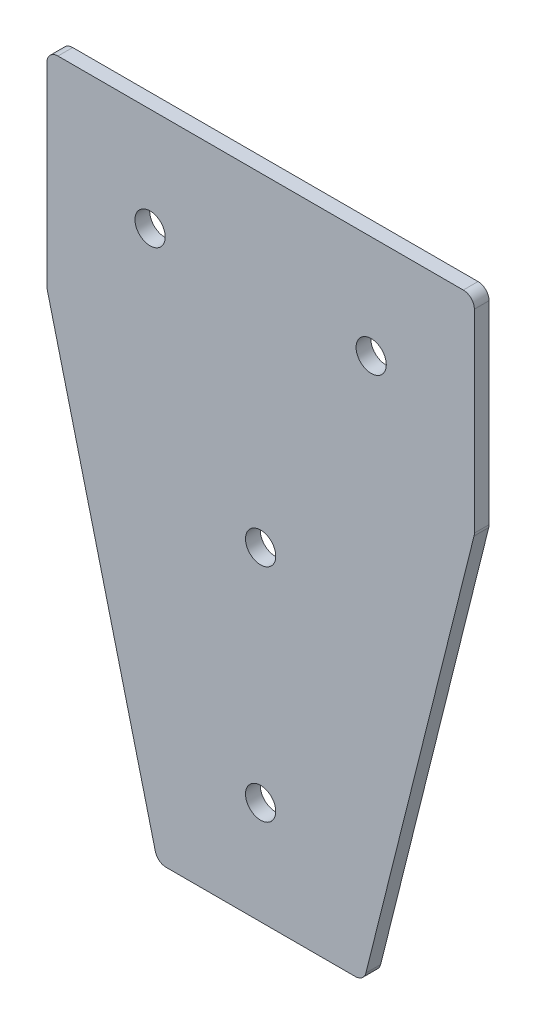
ISO-10303-21;
HEADER;
FILE_DESCRIPTION(('STEP AP214'),'2;1');
FILE_NAME('part.step','',(''),(''),'','','');
FILE_SCHEMA(('AUTOMOTIVE_DESIGN { 1 0 10303 214 1 1 1 1 }'));
ENDSEC;
DATA;
#1=APPLICATION_CONTEXT('core data for automotive mechanical design processes');
#2=APPLICATION_PROTOCOL_DEFINITION('international standard','automotive_design',2000,#1);
#3=PRODUCT_CONTEXT('',#1,'mechanical');
#4=PRODUCT('Part','Part','',(#3));
#5=PRODUCT_RELATED_PRODUCT_CATEGORY('part','',(#4));
#6=PRODUCT_DEFINITION_FORMATION('','',#4);
#7=PRODUCT_DEFINITION_CONTEXT('part definition',#1,'design');
#8=PRODUCT_DEFINITION('design','',#6,#7);
#9=PRODUCT_DEFINITION_SHAPE('','',#8);
#10=(LENGTH_UNIT() NAMED_UNIT(*) SI_UNIT(.MILLI.,.METRE.));
#11=(NAMED_UNIT(*) PLANE_ANGLE_UNIT() SI_UNIT($,.RADIAN.));
#12=(NAMED_UNIT(*) SI_UNIT($,.STERADIAN.) SOLID_ANGLE_UNIT());
#13=UNCERTAINTY_MEASURE_WITH_UNIT(LENGTH_MEASURE(1.E-05),#10,'distance_accuracy_value','');
#14=(GEOMETRIC_REPRESENTATION_CONTEXT(3) GLOBAL_UNCERTAINTY_ASSIGNED_CONTEXT((#13)) GLOBAL_UNIT_ASSIGNED_CONTEXT((#10,
#11,#12)) REPRESENTATION_CONTEXT('',''));
#15=CARTESIAN_POINT('',(0.,0.,0.));
#16=DIRECTION('',(0.,0.,1.));
#17=DIRECTION('',(1.,0.,0.));
#18=AXIS2_PLACEMENT_3D('',#15,#16,#17);
#19=CARTESIAN_POINT('',(0.,0.,4.));
#20=DIRECTION('',(0.,0.,1.));
#21=DIRECTION('',(1.,0.,0.));
#22=AXIS2_PLACEMENT_3D('',#19,#20,#21);
#23=PLANE('',#22);
#24=CARTESIAN_POINT('',(30.0000000000006,-120.000000000001,4.));
#25=DIRECTION('',(0.,0.,1.));
#26=DIRECTION('',(1.,0.,0.));
#27=AXIS2_PLACEMENT_3D('',#24,#25,#26);
#28=CIRCLE('',#27,4.09999999999998);
#29=CARTESIAN_POINT('',(34.1000000000006,-120.000000000001,4.));
#30=VERTEX_POINT('',#29);
#31=EDGE_CURVE('E214',#30,#30,#28,.T.);
#32=ORIENTED_EDGE('',*,*,#31,.F.);
#33=EDGE_LOOP('',(#32));
#34=FACE_BOUND('',#33,.T.);
#35=CARTESIAN_POINT('',(0.,0.,4.));
#36=DIRECTION('',(0.,0.,1.));
#37=DIRECTION('',(1.,0.,0.));
#38=AXIS2_PLACEMENT_3D('',#35,#36,#37);
#39=CIRCLE('',#38,4.1);
#40=CARTESIAN_POINT('',(4.1,0.,4.));
#41=VERTEX_POINT('',#40);
#42=EDGE_CURVE('E204',#41,#41,#39,.T.);
#43=ORIENTED_EDGE('',*,*,#42,.F.);
#44=EDGE_LOOP('',(#43));
#45=FACE_BOUND('',#44,.T.);
#46=DIRECTION('',(0.242535625036333,0.970142500145332,0.));
#47=VECTOR('',#46,1.);
#48=CARTESIAN_POINT('',(88.,-28.,4.));
#49=LINE('',#48,#47);
#50=CARTESIAN_POINT('',(58.5680982812228,-145.727606875109,4.));
#51=VERTEX_POINT('',#50);
#52=CARTESIAN_POINT('',(87.910427500436,-28.3582899982562,4.));
#53=VERTEX_POINT('',#52);
#54=EDGE_CURVE('E236',#51,#53,#49,.T.);
#55=ORIENTED_EDGE('',*,*,#54,.T.);
#56=CARTESIAN_POINT('',(85.,-27.6306831231472,4.));
#57=DIRECTION('',(0.,0.,1.));
#58=DIRECTION('',(1.,0.,0.));
#59=AXIS2_PLACEMENT_3D('',#56,#57,#58);
#60=CIRCLE('',#59,3.);
#61=CARTESIAN_POINT('',(88.,-27.6306831231472,4.));
#62=VERTEX_POINT('',#61);
#63=EDGE_CURVE('E163',#53,#62,#60,.T.);
#64=ORIENTED_EDGE('',*,*,#63,.T.);
#65=DIRECTION('',(0.,1.,0.));
#66=VECTOR('',#65,1.);
#67=CARTESIAN_POINT('',(88.,28.,4.));
#68=LINE('',#67,#66);
#69=CARTESIAN_POINT('',(88.,25.,4.));
#70=VERTEX_POINT('',#69);
#71=EDGE_CURVE('E124',#62,#70,#68,.T.);
#72=ORIENTED_EDGE('',*,*,#71,.T.);
#73=CARTESIAN_POINT('',(85.,25.,4.));
#74=DIRECTION('',(0.,0.,1.));
#75=DIRECTION('',(1.,0.,0.));
#76=AXIS2_PLACEMENT_3D('',#73,#74,#75);
#77=CIRCLE('',#76,3.);
#78=CARTESIAN_POINT('',(85.,28.,4.));
#79=VERTEX_POINT('',#78);
#80=EDGE_CURVE('E36',#70,#79,#77,.T.);
#81=ORIENTED_EDGE('',*,*,#80,.T.);
#82=DIRECTION('',(-1.,0.,0.));
#83=VECTOR('',#82,1.);
#84=CARTESIAN_POINT('',(-28.,28.,4.));
#85=LINE('',#84,#83);
#86=CARTESIAN_POINT('',(-25.,28.,4.));
#87=VERTEX_POINT('',#86);
#88=EDGE_CURVE('E141',#79,#87,#85,.T.);
#89=ORIENTED_EDGE('',*,*,#88,.T.);
#90=CARTESIAN_POINT('',(-25.,25.,4.));
#91=DIRECTION('',(0.,0.,1.));
#92=DIRECTION('',(1.,0.,0.));
#93=AXIS2_PLACEMENT_3D('',#90,#91,#92);
#94=CIRCLE('',#93,3.);
#95=CARTESIAN_POINT('',(-28.,25.,4.));
#96=VERTEX_POINT('',#95);
#97=EDGE_CURVE('E155',#87,#96,#94,.T.);
#98=ORIENTED_EDGE('',*,*,#97,.T.);
#99=DIRECTION('',(0.,-1.,0.));
#100=VECTOR('',#99,1.);
#101=CARTESIAN_POINT('',(-28.,28.,4.));
#102=LINE('',#101,#100);
#103=CARTESIAN_POINT('',(-28.,-27.630683123147,4.));
#104=VERTEX_POINT('',#103);
#105=EDGE_CURVE('E134',#96,#104,#102,.T.);
#106=ORIENTED_EDGE('',*,*,#105,.T.);
#107=CARTESIAN_POINT('',(-25.,-27.630683123147,4.));
#108=DIRECTION('',(0.,0.,1.));
#109=DIRECTION('',(1.,0.,0.));
#110=AXIS2_PLACEMENT_3D('',#107,#108,#109);
#111=CIRCLE('',#110,3.);
#112=CARTESIAN_POINT('',(-27.910427500436,-28.358289998256,4.));
#113=VERTEX_POINT('',#112);
#114=EDGE_CURVE('E157',#104,#113,#111,.T.);
#115=ORIENTED_EDGE('',*,*,#114,.T.);
#116=DIRECTION('',(0.242535625036333,-0.970142500145332,0.));
#117=VECTOR('',#116,1.);
#118=CARTESIAN_POINT('',(-28.,-28.,4.));
#119=LINE('',#118,#117);
#120=CARTESIAN_POINT('',(1.43190171877727,-145.727606875109,4.));
#121=VERTEX_POINT('',#120);
#122=EDGE_CURVE('E231',#113,#121,#119,.T.);
#123=ORIENTED_EDGE('',*,*,#122,.T.);
#124=CARTESIAN_POINT('',(4.34232921921326,-145.,4.));
#125=DIRECTION('',(0.,0.,1.));
#126=DIRECTION('',(1.,0.,0.));
#127=AXIS2_PLACEMENT_3D('',#124,#125,#126);
#128=CIRCLE('',#127,3.);
#129=CARTESIAN_POINT('',(4.34232921921326,-148.,4.));
#130=VERTEX_POINT('',#129);
#131=EDGE_CURVE('E159',#121,#130,#128,.T.);
#132=ORIENTED_EDGE('',*,*,#131,.T.);
#133=DIRECTION('',(1.,0.,0.));
#134=VECTOR('',#133,1.);
#135=CARTESIAN_POINT('',(2.00000000000002,-148.,4.));
#136=LINE('',#135,#134);
#137=CARTESIAN_POINT('',(55.6576707807868,-148.,4.));
#138=VERTEX_POINT('',#137);
#139=EDGE_CURVE('E195',#130,#138,#136,.T.);
#140=ORIENTED_EDGE('',*,*,#139,.T.);
#141=CARTESIAN_POINT('',(55.6576707807868,-145.,4.));
#142=DIRECTION('',(0.,0.,1.));
#143=DIRECTION('',(1.,0.,0.));
#144=AXIS2_PLACEMENT_3D('',#141,#142,#143);
#145=CIRCLE('',#144,3.);
#146=EDGE_CURVE('E161',#138,#51,#145,.T.);
#147=ORIENTED_EDGE('',*,*,#146,.T.);
#148=EDGE_LOOP('',(#55,#64,#72,#81,#89,#98,#106,#115,#123,#132,#140,#147));
#149=FACE_BOUND('',#148,.T.);
#150=CARTESIAN_POINT('',(60.,0.,4.));
#151=DIRECTION('',(0.,0.,1.));
#152=DIRECTION('',(1.,0.,0.));
#153=AXIS2_PLACEMENT_3D('',#150,#151,#152);
#154=CIRCLE('',#153,4.09999999999999);
#155=CARTESIAN_POINT('',(64.1,0.,4.));
#156=VERTEX_POINT('',#155);
#157=EDGE_CURVE('E209',#156,#156,#154,.T.);
#158=ORIENTED_EDGE('',*,*,#157,.F.);
#159=EDGE_LOOP('',(#158));
#160=FACE_BOUND('',#159,.T.);
#161=CARTESIAN_POINT('',(30.,-60.,4.));
#162=DIRECTION('',(0.,0.,1.));
#163=DIRECTION('',(1.,0.,0.));
#164=AXIS2_PLACEMENT_3D('',#161,#162,#163);
#165=CIRCLE('',#164,4.1);
#166=CARTESIAN_POINT('',(34.1,-60.,4.));
#167=VERTEX_POINT('',#166);
#168=EDGE_CURVE('E220',#167,#167,#165,.T.);
#169=ORIENTED_EDGE('',*,*,#168,.F.);
#170=EDGE_LOOP('',(#169));
#171=FACE_BOUND('',#170,.T.);
#172=ADVANCED_FACE('F16',(#34,#45,#149,#160,#171),#23,.T.);
#173=CARTESIAN_POINT('',(0.,0.,0.));
#174=DIRECTION('',(0.,0.,1.));
#175=DIRECTION('',(1.,0.,0.));
#176=AXIS2_PLACEMENT_3D('',#173,#174,#175);
#177=PLANE('',#176);
#178=DIRECTION('',(0.,1.,0.));
#179=VECTOR('',#178,1.);
#180=CARTESIAN_POINT('',(88.,28.,0.));
#181=LINE('',#180,#179);
#182=CARTESIAN_POINT('',(88.,-27.6306831231472,0.));
#183=VERTEX_POINT('',#182);
#184=CARTESIAN_POINT('',(88.,25.,0.));
#185=VERTEX_POINT('',#184);
#186=EDGE_CURVE('E122',#183,#185,#181,.T.);
#187=ORIENTED_EDGE('',*,*,#186,.F.);
#188=CARTESIAN_POINT('',(85.,-27.6306831231472,0.));
#189=DIRECTION('',(0.,0.,1.));
#190=DIRECTION('',(1.,0.,0.));
#191=AXIS2_PLACEMENT_3D('',#188,#189,#190);
#192=CIRCLE('',#191,3.);
#193=CARTESIAN_POINT('',(87.910427500436,-28.3582899982562,0.));
#194=VERTEX_POINT('',#193);
#195=EDGE_CURVE('E105',#183,#194,#192,.F.);
#196=ORIENTED_EDGE('',*,*,#195,.T.);
#197=DIRECTION('',(-0.242535625036333,-0.970142500145332,0.));
#198=VECTOR('',#197,1.);
#199=CARTESIAN_POINT('',(88.,-28.,0.));
#200=LINE('',#199,#198);
#201=CARTESIAN_POINT('',(58.5680982812228,-145.727606875109,0.));
#202=VERTEX_POINT('',#201);
#203=EDGE_CURVE('E234',#194,#202,#200,.T.);
#204=ORIENTED_EDGE('',*,*,#203,.T.);
#205=CARTESIAN_POINT('',(55.6576707807868,-145.,0.));
#206=DIRECTION('',(0.,0.,1.));
#207=DIRECTION('',(1.,0.,0.));
#208=AXIS2_PLACEMENT_3D('',#205,#206,#207);
#209=CIRCLE('',#208,3.);
#210=CARTESIAN_POINT('',(55.6576707807868,-148.,0.));
#211=VERTEX_POINT('',#210);
#212=EDGE_CURVE('E116',#202,#211,#209,.F.);
#213=ORIENTED_EDGE('',*,*,#212,.T.);
#214=DIRECTION('',(1.,0.,0.));
#215=VECTOR('',#214,1.);
#216=CARTESIAN_POINT('',(2.00000000000002,-148.,0.));
#217=LINE('',#216,#215);
#218=CARTESIAN_POINT('',(4.34232921921326,-148.,0.));
#219=VERTEX_POINT('',#218);
#220=EDGE_CURVE('E132',#219,#211,#217,.T.);
#221=ORIENTED_EDGE('',*,*,#220,.F.);
#222=CARTESIAN_POINT('',(4.34232921921326,-145.,0.));
#223=DIRECTION('',(0.,0.,1.));
#224=DIRECTION('',(1.,0.,0.));
#225=AXIS2_PLACEMENT_3D('',#222,#223,#224);
#226=CIRCLE('',#225,3.);
#227=CARTESIAN_POINT('',(1.43190171877727,-145.727606875109,0.));
#228=VERTEX_POINT('',#227);
#229=EDGE_CURVE('E148',#219,#228,#226,.F.);
#230=ORIENTED_EDGE('',*,*,#229,.T.);
#231=DIRECTION('',(-0.242535625036333,0.970142500145332,0.));
#232=VECTOR('',#231,1.);
#233=CARTESIAN_POINT('',(-28.,-28.,0.));
#234=LINE('',#233,#232);
#235=CARTESIAN_POINT('',(-27.910427500436,-28.358289998256,0.));
#236=VERTEX_POINT('',#235);
#237=EDGE_CURVE('E226',#228,#236,#234,.T.);
#238=ORIENTED_EDGE('',*,*,#237,.T.);
#239=CARTESIAN_POINT('',(-25.,-27.630683123147,0.));
#240=DIRECTION('',(0.,0.,1.));
#241=DIRECTION('',(1.,0.,0.));
#242=AXIS2_PLACEMENT_3D('',#239,#240,#241);
#243=CIRCLE('',#242,3.);
#244=CARTESIAN_POINT('',(-28.,-27.630683123147,0.));
#245=VERTEX_POINT('',#244);
#246=EDGE_CURVE('E146',#236,#245,#243,.F.);
#247=ORIENTED_EDGE('',*,*,#246,.T.);
#248=DIRECTION('',(0.,-1.,0.));
#249=VECTOR('',#248,1.);
#250=CARTESIAN_POINT('',(-28.,28.,0.));
#251=LINE('',#250,#249);
#252=CARTESIAN_POINT('',(-28.,25.,0.));
#253=VERTEX_POINT('',#252);
#254=EDGE_CURVE('E137',#253,#245,#251,.T.);
#255=ORIENTED_EDGE('',*,*,#254,.F.);
#256=CARTESIAN_POINT('',(-25.,25.,0.));
#257=DIRECTION('',(0.,0.,1.));
#258=DIRECTION('',(1.,0.,0.));
#259=AXIS2_PLACEMENT_3D('',#256,#257,#258);
#260=CIRCLE('',#259,3.);
#261=CARTESIAN_POINT('',(-25.,28.,0.));
#262=VERTEX_POINT('',#261);
#263=EDGE_CURVE('E144',#253,#262,#260,.F.);
#264=ORIENTED_EDGE('',*,*,#263,.T.);
#265=DIRECTION('',(-1.,0.,0.));
#266=VECTOR('',#265,1.);
#267=CARTESIAN_POINT('',(-28.,28.,0.));
#268=LINE('',#267,#266);
#269=CARTESIAN_POINT('',(85.,28.,0.));
#270=VERTEX_POINT('',#269);
#271=EDGE_CURVE('E131',#270,#262,#268,.T.);
#272=ORIENTED_EDGE('',*,*,#271,.F.);
#273=CARTESIAN_POINT('',(85.,25.,0.));
#274=DIRECTION('',(0.,0.,1.));
#275=DIRECTION('',(1.,0.,0.));
#276=AXIS2_PLACEMENT_3D('',#273,#274,#275);
#277=CIRCLE('',#276,3.);
#278=EDGE_CURVE('E125',#270,#185,#277,.F.);
#279=ORIENTED_EDGE('',*,*,#278,.T.);
#280=EDGE_LOOP('',(#187,#196,#204,#213,#221,#230,#238,#247,#255,#264,#272,#279));
#281=FACE_BOUND('',#280,.T.);
#282=CARTESIAN_POINT('',(0.,0.,0.));
#283=DIRECTION('',(0.,0.,1.));
#284=DIRECTION('',(1.,0.,0.));
#285=AXIS2_PLACEMENT_3D('',#282,#283,#284);
#286=CIRCLE('',#285,4.1);
#287=CARTESIAN_POINT('',(4.1,0.,0.));
#288=VERTEX_POINT('',#287);
#289=EDGE_CURVE('E200',#288,#288,#286,.T.);
#290=ORIENTED_EDGE('',*,*,#289,.T.);
#291=EDGE_LOOP('',(#290));
#292=FACE_BOUND('',#291,.T.);
#293=CARTESIAN_POINT('',(60.,0.,0.));
#294=DIRECTION('',(0.,0.,1.));
#295=DIRECTION('',(1.,0.,0.));
#296=AXIS2_PLACEMENT_3D('',#293,#294,#295);
#297=CIRCLE('',#296,4.09999999999999);
#298=CARTESIAN_POINT('',(64.1,0.,0.));
#299=VERTEX_POINT('',#298);
#300=EDGE_CURVE('E211',#299,#299,#297,.T.);
#301=ORIENTED_EDGE('',*,*,#300,.T.);
#302=EDGE_LOOP('',(#301));
#303=FACE_BOUND('',#302,.T.);
#304=CARTESIAN_POINT('',(30.0000000000006,-120.000000000001,0.));
#305=DIRECTION('',(0.,0.,1.));
#306=DIRECTION('',(1.,0.,0.));
#307=AXIS2_PLACEMENT_3D('',#304,#305,#306);
#308=CIRCLE('',#307,4.09999999999998);
#309=CARTESIAN_POINT('',(34.1000000000006,-120.000000000001,0.));
#310=VERTEX_POINT('',#309);
#311=EDGE_CURVE('E217',#310,#310,#308,.T.);
#312=ORIENTED_EDGE('',*,*,#311,.T.);
#313=EDGE_LOOP('',(#312));
#314=FACE_BOUND('',#313,.T.);
#315=CARTESIAN_POINT('',(30.,-60.,0.));
#316=DIRECTION('',(0.,0.,1.));
#317=DIRECTION('',(1.,0.,0.));
#318=AXIS2_PLACEMENT_3D('',#315,#316,#317);
#319=CIRCLE('',#318,4.1);
#320=CARTESIAN_POINT('',(34.1,-60.,0.));
#321=VERTEX_POINT('',#320);
#322=EDGE_CURVE('E223',#321,#321,#319,.T.);
#323=ORIENTED_EDGE('',*,*,#322,.T.);
#324=EDGE_LOOP('',(#323));
#325=FACE_BOUND('',#324,.T.);
#326=ADVANCED_FACE('F128',(#281,#292,#303,#314,#325),#177,.F.);
#327=CARTESIAN_POINT('',(-28.,28.,4.));
#328=DIRECTION('',(1.,0.,0.));
#329=DIRECTION('',(0.,1.,0.));
#330=AXIS2_PLACEMENT_3D('',#327,#328,#329);
#331=PLANE('',#330);
#332=ORIENTED_EDGE('',*,*,#254,.T.);
#333=DIRECTION('',(0.,0.,-1.));
#334=VECTOR('',#333,1.);
#335=CARTESIAN_POINT('',(-28.,-27.630683123147,4.));
#336=LINE('',#335,#334);
#337=EDGE_CURVE('E178',#245,#104,#336,.F.);
#338=ORIENTED_EDGE('',*,*,#337,.T.);
#339=ORIENTED_EDGE('',*,*,#105,.F.);
#340=DIRECTION('',(0.,0.,-1.));
#341=VECTOR('',#340,1.);
#342=CARTESIAN_POINT('',(-28.,25.,4.));
#343=LINE('',#342,#341);
#344=EDGE_CURVE('E175',#96,#253,#343,.T.);
#345=ORIENTED_EDGE('',*,*,#344,.T.);
#346=EDGE_LOOP('',(#332,#338,#339,#345));
#347=FACE_BOUND('',#346,.T.);
#348=ADVANCED_FACE('F191',(#347),#331,.F.);
#349=CARTESIAN_POINT('',(2.00000000000002,-148.,4.));
#350=DIRECTION('',(0.,1.,0.));
#351=DIRECTION('',(0.,0.,1.));
#352=AXIS2_PLACEMENT_3D('',#349,#350,#351);
#353=PLANE('',#352);
#354=ORIENTED_EDGE('',*,*,#220,.T.);
#355=DIRECTION('',(0.,0.,-1.));
#356=VECTOR('',#355,1.);
#357=CARTESIAN_POINT('',(55.6576707807868,-148.,4.));
#358=LINE('',#357,#356);
#359=EDGE_CURVE('E168',#211,#138,#358,.F.);
#360=ORIENTED_EDGE('',*,*,#359,.T.);
#361=ORIENTED_EDGE('',*,*,#139,.F.);
#362=DIRECTION('',(0.,0.,-1.));
#363=VECTOR('',#362,1.);
#364=CARTESIAN_POINT('',(4.34232921921326,-148.,0.));
#365=LINE('',#364,#363);
#366=EDGE_CURVE('E165',#130,#219,#365,.T.);
#367=ORIENTED_EDGE('',*,*,#366,.T.);
#368=EDGE_LOOP('',(#354,#360,#361,#367));
#369=FACE_BOUND('',#368,.T.);
#370=ADVANCED_FACE('F249',(#369),#353,.F.);
#371=CARTESIAN_POINT('',(88.,28.,4.));
#372=DIRECTION('',(-1.,0.,0.));
#373=DIRECTION('',(0.,0.,1.));
#374=AXIS2_PLACEMENT_3D('',#371,#372,#373);
#375=PLANE('',#374);
#376=ORIENTED_EDGE('',*,*,#71,.F.);
#377=DIRECTION('',(0.,0.,-1.));
#378=VECTOR('',#377,1.);
#379=CARTESIAN_POINT('',(88.,-27.6306831231472,0.));
#380=LINE('',#379,#378);
#381=EDGE_CURVE('E109',#62,#183,#380,.T.);
#382=ORIENTED_EDGE('',*,*,#381,.T.);
#383=ORIENTED_EDGE('',*,*,#186,.T.);
#384=DIRECTION('',(0.,0.,-1.));
#385=VECTOR('',#384,1.);
#386=CARTESIAN_POINT('',(88.,25.,4.));
#387=LINE('',#386,#385);
#388=EDGE_CURVE('E126',#185,#70,#387,.F.);
#389=ORIENTED_EDGE('',*,*,#388,.T.);
#390=EDGE_LOOP('',(#376,#382,#383,#389));
#391=FACE_BOUND('',#390,.T.);
#392=ADVANCED_FACE('F121',(#391),#375,.F.);
#393=CARTESIAN_POINT('',(-28.,28.,4.));
#394=DIRECTION('',(0.,-1.,0.));
#395=DIRECTION('',(1.,0.,0.));
#396=AXIS2_PLACEMENT_3D('',#393,#394,#395);
#397=PLANE('',#396);
#398=ORIENTED_EDGE('',*,*,#271,.T.);
#399=DIRECTION('',(0.,0.,-1.));
#400=VECTOR('',#399,1.);
#401=CARTESIAN_POINT('',(-25.,28.,4.));
#402=LINE('',#401,#400);
#403=EDGE_CURVE('E10',#262,#87,#402,.F.);
#404=ORIENTED_EDGE('',*,*,#403,.T.);
#405=ORIENTED_EDGE('',*,*,#88,.F.);
#406=DIRECTION('',(0.,0.,-1.));
#407=VECTOR('',#406,1.);
#408=CARTESIAN_POINT('',(85.,28.,4.));
#409=LINE('',#408,#407);
#410=EDGE_CURVE('E24',#79,#270,#409,.T.);
#411=ORIENTED_EDGE('',*,*,#410,.T.);
#412=EDGE_LOOP('',(#398,#404,#405,#411));
#413=FACE_BOUND('',#412,.T.);
#414=ADVANCED_FACE('F181',(#413),#397,.F.);
#415=CARTESIAN_POINT('',(0.,0.,4.));
#416=DIRECTION('',(0.,0.,-1.));
#417=DIRECTION('',(-1.,0.,0.));
#418=AXIS2_PLACEMENT_3D('',#415,#416,#417);
#419=CYLINDRICAL_SURFACE('',#418,4.1);
#420=ORIENTED_EDGE('',*,*,#42,.T.);
#421=EDGE_LOOP('',(#420));
#422=FACE_BOUND('',#421,.T.);
#423=ORIENTED_EDGE('',*,*,#289,.F.);
#424=EDGE_LOOP('',(#423));
#425=FACE_BOUND('',#424,.T.);
#426=ADVANCED_FACE('F281',(#422,#425),#419,.F.);
#427=CARTESIAN_POINT('',(60.,0.,4.));
#428=DIRECTION('',(0.,0.,-1.));
#429=DIRECTION('',(-1.,0.,0.));
#430=AXIS2_PLACEMENT_3D('',#427,#428,#429);
#431=CYLINDRICAL_SURFACE('',#430,4.09999999999999);
#432=ORIENTED_EDGE('',*,*,#157,.T.);
#433=EDGE_LOOP('',(#432));
#434=FACE_BOUND('',#433,.T.);
#435=ORIENTED_EDGE('',*,*,#300,.F.);
#436=EDGE_LOOP('',(#435));
#437=FACE_BOUND('',#436,.T.);
#438=ADVANCED_FACE('F356',(#434,#437),#431,.F.);
#439=CARTESIAN_POINT('',(30.0000000000006,-120.000000000001,4.));
#440=DIRECTION('',(0.,0.,-1.));
#441=DIRECTION('',(-1.,0.,0.));
#442=AXIS2_PLACEMENT_3D('',#439,#440,#441);
#443=CYLINDRICAL_SURFACE('',#442,4.09999999999998);
#444=ORIENTED_EDGE('',*,*,#31,.T.);
#445=EDGE_LOOP('',(#444));
#446=FACE_BOUND('',#445,.T.);
#447=ORIENTED_EDGE('',*,*,#311,.F.);
#448=EDGE_LOOP('',(#447));
#449=FACE_BOUND('',#448,.T.);
#450=ADVANCED_FACE('F364',(#446,#449),#443,.F.);
#451=CARTESIAN_POINT('',(30.,-60.,4.));
#452=DIRECTION('',(0.,0.,-1.));
#453=DIRECTION('',(-1.,0.,0.));
#454=AXIS2_PLACEMENT_3D('',#451,#452,#453);
#455=CYLINDRICAL_SURFACE('',#454,4.1);
#456=ORIENTED_EDGE('',*,*,#168,.T.);
#457=EDGE_LOOP('',(#456));
#458=FACE_BOUND('',#457,.T.);
#459=ORIENTED_EDGE('',*,*,#322,.F.);
#460=EDGE_LOOP('',(#459));
#461=FACE_BOUND('',#460,.T.);
#462=ADVANCED_FACE('F347',(#458,#461),#455,.F.);
#463=CARTESIAN_POINT('',(-28.,-28.,-123.69316876853));
#464=DIRECTION('',(-0.970142500145332,-0.242535625036333,0.));
#465=DIRECTION('',(0.242535625036333,-0.970142500145332,0.));
#466=AXIS2_PLACEMENT_3D('',#463,#464,#465);
#467=PLANE('',#466);
#468=ORIENTED_EDGE('',*,*,#237,.F.);
#469=DIRECTION('',(0.,0.,-1.));
#470=VECTOR('',#469,1.);
#471=CARTESIAN_POINT('',(1.43190171877727,-145.727606875109,4.));
#472=LINE('',#471,#470);
#473=EDGE_CURVE('E173',#228,#121,#472,.F.);
#474=ORIENTED_EDGE('',*,*,#473,.T.);
#475=ORIENTED_EDGE('',*,*,#122,.F.);
#476=DIRECTION('',(0.,0.,-1.));
#477=VECTOR('',#476,1.);
#478=CARTESIAN_POINT('',(-27.910427500436,-28.358289998256,0.));
#479=LINE('',#478,#477);
#480=EDGE_CURVE('E170',#113,#236,#479,.T.);
#481=ORIENTED_EDGE('',*,*,#480,.T.);
#482=EDGE_LOOP('',(#468,#474,#475,#481));
#483=FACE_BOUND('',#482,.T.);
#484=ADVANCED_FACE('F258',(#483),#467,.T.);
#485=CARTESIAN_POINT('',(88.,-28.,-123.69316876853));
#486=DIRECTION('',(0.970142500145332,-0.242535625036333,0.));
#487=DIRECTION('',(0.242535625036333,0.970142500145332,0.));
#488=AXIS2_PLACEMENT_3D('',#485,#486,#487);
#489=PLANE('',#488);
#490=ORIENTED_EDGE('',*,*,#203,.F.);
#491=DIRECTION('',(0.,0.,-1.));
#492=VECTOR('',#491,1.);
#493=CARTESIAN_POINT('',(87.910427500436,-28.3582899982562,4.));
#494=LINE('',#493,#492);
#495=EDGE_CURVE('E110',#194,#53,#494,.F.);
#496=ORIENTED_EDGE('',*,*,#495,.T.);
#497=ORIENTED_EDGE('',*,*,#54,.F.);
#498=DIRECTION('',(0.,0.,-1.));
#499=VECTOR('',#498,1.);
#500=CARTESIAN_POINT('',(58.5680982812228,-145.727606875109,0.));
#501=LINE('',#500,#499);
#502=EDGE_CURVE('E115',#51,#202,#501,.T.);
#503=ORIENTED_EDGE('',*,*,#502,.T.);
#504=EDGE_LOOP('',(#490,#496,#497,#503));
#505=FACE_BOUND('',#504,.T.);
#506=ADVANCED_FACE('F243',(#505),#489,.T.);
#507=CARTESIAN_POINT('',(85.,-27.6306831231472,4.));
#508=DIRECTION('',(0.,0.,1.));
#509=DIRECTION('',(1.,0.,0.));
#510=AXIS2_PLACEMENT_3D('',#507,#508,#509);
#511=CYLINDRICAL_SURFACE('',#510,3.);
#512=ORIENTED_EDGE('',*,*,#63,.F.);
#513=ORIENTED_EDGE('',*,*,#495,.F.);
#514=ORIENTED_EDGE('',*,*,#195,.F.);
#515=ORIENTED_EDGE('',*,*,#381,.F.);
#516=EDGE_LOOP('',(#512,#513,#514,#515));
#517=FACE_BOUND('',#516,.T.);
#518=ADVANCED_FACE('F108',(#517),#511,.T.);
#519=CARTESIAN_POINT('',(55.6576707807868,-145.,-123.69316876853));
#520=DIRECTION('',(0.,0.,1.));
#521=DIRECTION('',(1.,0.,0.));
#522=AXIS2_PLACEMENT_3D('',#519,#520,#521);
#523=CYLINDRICAL_SURFACE('',#522,3.);
#524=ORIENTED_EDGE('',*,*,#146,.F.);
#525=ORIENTED_EDGE('',*,*,#359,.F.);
#526=ORIENTED_EDGE('',*,*,#212,.F.);
#527=ORIENTED_EDGE('',*,*,#502,.F.);
#528=EDGE_LOOP('',(#524,#525,#526,#527));
#529=FACE_BOUND('',#528,.T.);
#530=ADVANCED_FACE('F245',(#529),#523,.T.);
#531=CARTESIAN_POINT('',(4.34232921921326,-145.,4.));
#532=DIRECTION('',(0.,0.,1.));
#533=DIRECTION('',(1.,0.,0.));
#534=AXIS2_PLACEMENT_3D('',#531,#532,#533);
#535=CYLINDRICAL_SURFACE('',#534,3.);
#536=ORIENTED_EDGE('',*,*,#131,.F.);
#537=ORIENTED_EDGE('',*,*,#473,.F.);
#538=ORIENTED_EDGE('',*,*,#229,.F.);
#539=ORIENTED_EDGE('',*,*,#366,.F.);
#540=EDGE_LOOP('',(#536,#537,#538,#539));
#541=FACE_BOUND('',#540,.T.);
#542=ADVANCED_FACE('F254',(#541),#535,.T.);
#543=CARTESIAN_POINT('',(-25.,-27.630683123147,-123.69316876853));
#544=DIRECTION('',(0.,0.,1.));
#545=DIRECTION('',(1.,0.,0.));
#546=AXIS2_PLACEMENT_3D('',#543,#544,#545);
#547=CYLINDRICAL_SURFACE('',#546,3.);
#548=ORIENTED_EDGE('',*,*,#114,.F.);
#549=ORIENTED_EDGE('',*,*,#337,.F.);
#550=ORIENTED_EDGE('',*,*,#246,.F.);
#551=ORIENTED_EDGE('',*,*,#480,.F.);
#552=EDGE_LOOP('',(#548,#549,#550,#551));
#553=FACE_BOUND('',#552,.T.);
#554=ADVANCED_FACE('F262',(#553),#547,.T.);
#555=CARTESIAN_POINT('',(-25.,25.,4.));
#556=DIRECTION('',(0.,0.,-1.));
#557=DIRECTION('',(-1.,0.,0.));
#558=AXIS2_PLACEMENT_3D('',#555,#556,#557);
#559=CYLINDRICAL_SURFACE('',#558,3.);
#560=ORIENTED_EDGE('',*,*,#97,.F.);
#561=ORIENTED_EDGE('',*,*,#403,.F.);
#562=ORIENTED_EDGE('',*,*,#263,.F.);
#563=ORIENTED_EDGE('',*,*,#344,.F.);
#564=EDGE_LOOP('',(#560,#561,#562,#563));
#565=FACE_BOUND('',#564,.T.);
#566=ADVANCED_FACE('F188',(#565),#559,.T.);
#567=CARTESIAN_POINT('',(85.,25.,4.));
#568=DIRECTION('',(0.,0.,-1.));
#569=DIRECTION('',(-1.,0.,0.));
#570=AXIS2_PLACEMENT_3D('',#567,#568,#569);
#571=CYLINDRICAL_SURFACE('',#570,3.);
#572=ORIENTED_EDGE('',*,*,#80,.F.);
#573=ORIENTED_EDGE('',*,*,#388,.F.);
#574=ORIENTED_EDGE('',*,*,#278,.F.);
#575=ORIENTED_EDGE('',*,*,#410,.F.);
#576=EDGE_LOOP('',(#572,#573,#574,#575));
#577=FACE_BOUND('',#576,.T.);
#578=ADVANCED_FACE('F18',(#577),#571,.T.);
#579=CLOSED_SHELL('',(#172,#326,#348,#370,#392,#414,#426,#438,#450,#462,#484,#506,#518,#530,
#542,#554,#566,#578));
#580=MANIFOLD_SOLID_BREP('B1',#579);
#581=ADVANCED_BREP_SHAPE_REPRESENTATION('',(#18,#580),#14);
#582=SHAPE_DEFINITION_REPRESENTATION(#9,#581);
ENDSEC;
END-ISO-10303-21;
